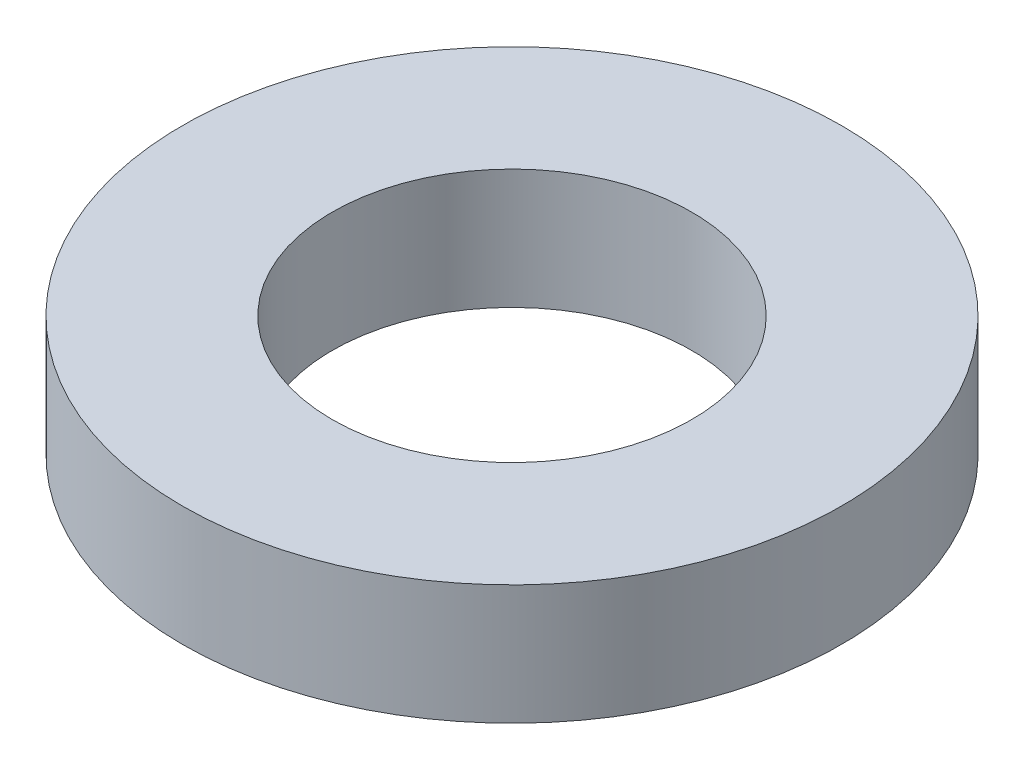
ISO-10303-21;
HEADER;
FILE_DESCRIPTION(('STEP AP214'),'2;1');
FILE_NAME('part.step','',(''),(''),'','','');
FILE_SCHEMA(('AUTOMOTIVE_DESIGN { 1 0 10303 214 1 1 1 1 }'));
ENDSEC;
DATA;
#1=APPLICATION_CONTEXT('core data for automotive mechanical design processes');
#2=APPLICATION_PROTOCOL_DEFINITION('international standard','automotive_design',2000,#1);
#3=PRODUCT_CONTEXT('',#1,'mechanical');
#4=PRODUCT('Part','Part','',(#3));
#5=PRODUCT_RELATED_PRODUCT_CATEGORY('part','',(#4));
#6=PRODUCT_DEFINITION_FORMATION('','',#4);
#7=PRODUCT_DEFINITION_CONTEXT('part definition',#1,'design');
#8=PRODUCT_DEFINITION('design','',#6,#7);
#9=PRODUCT_DEFINITION_SHAPE('','',#8);
#10=(LENGTH_UNIT() NAMED_UNIT(*) SI_UNIT(.MILLI.,.METRE.));
#11=(NAMED_UNIT(*) PLANE_ANGLE_UNIT() SI_UNIT($,.RADIAN.));
#12=(NAMED_UNIT(*) SI_UNIT($,.STERADIAN.) SOLID_ANGLE_UNIT());
#13=UNCERTAINTY_MEASURE_WITH_UNIT(LENGTH_MEASURE(1.E-05),#10,'distance_accuracy_value','');
#14=(GEOMETRIC_REPRESENTATION_CONTEXT(3) GLOBAL_UNCERTAINTY_ASSIGNED_CONTEXT((#13)) GLOBAL_UNIT_ASSIGNED_CONTEXT((#10,
#11,#12)) REPRESENTATION_CONTEXT('',''));
#15=CARTESIAN_POINT('',(0.,0.,0.));
#16=DIRECTION('',(0.,0.,1.));
#17=DIRECTION('',(1.,0.,0.));
#18=AXIS2_PLACEMENT_3D('',#15,#16,#17);
#19=CARTESIAN_POINT('',(0.,1.,0.));
#20=DIRECTION('',(0.,1.,0.));
#21=DIRECTION('',(0.,0.,1.));
#22=AXIS2_PLACEMENT_3D('',#19,#20,#21);
#23=PLANE('',#22);
#24=CARTESIAN_POINT('',(0.,1.,0.));
#25=DIRECTION('',(0.,1.,0.));
#26=DIRECTION('',(0.,0.,1.));
#27=AXIS2_PLACEMENT_3D('',#24,#25,#26);
#28=CIRCLE('',#27,2.75);
#29=CARTESIAN_POINT('',(0.,1.,2.75));
#30=VERTEX_POINT('',#29);
#31=EDGE_CURVE('E10',#30,#30,#28,.T.);
#32=ORIENTED_EDGE('',*,*,#31,.T.);
#33=EDGE_LOOP('',(#32));
#34=FACE_BOUND('',#33,.T.);
#35=CARTESIAN_POINT('',(0.,1.,0.));
#36=DIRECTION('',(0.,1.,0.));
#37=DIRECTION('',(0.,0.,1.));
#38=AXIS2_PLACEMENT_3D('',#35,#36,#37);
#39=CIRCLE('',#38,1.5);
#40=CARTESIAN_POINT('',(0.,1.,1.5));
#41=VERTEX_POINT('',#40);
#42=EDGE_CURVE('E50',#41,#41,#39,.T.);
#43=ORIENTED_EDGE('',*,*,#42,.F.);
#44=EDGE_LOOP('',(#43));
#45=FACE_BOUND('',#44,.T.);
#46=ADVANCED_FACE('F39',(#34,#45),#23,.T.);
#47=CARTESIAN_POINT('',(0.,0.,0.));
#48=DIRECTION('',(0.,1.,0.));
#49=DIRECTION('',(0.,0.,1.));
#50=AXIS2_PLACEMENT_3D('',#47,#48,#49);
#51=PLANE('',#50);
#52=CARTESIAN_POINT('',(0.,0.,0.));
#53=DIRECTION('',(0.,1.,0.));
#54=DIRECTION('',(0.,0.,1.));
#55=AXIS2_PLACEMENT_3D('',#52,#53,#54);
#56=CIRCLE('',#55,2.75);
#57=CARTESIAN_POINT('',(0.,0.,2.75));
#58=VERTEX_POINT('',#57);
#59=EDGE_CURVE('E43',#58,#58,#56,.T.);
#60=ORIENTED_EDGE('',*,*,#59,.F.);
#61=EDGE_LOOP('',(#60));
#62=FACE_BOUND('',#61,.T.);
#63=CARTESIAN_POINT('',(0.,0.,0.));
#64=DIRECTION('',(0.,1.,0.));
#65=DIRECTION('',(0.,0.,1.));
#66=AXIS2_PLACEMENT_3D('',#63,#64,#65);
#67=CIRCLE('',#66,1.5);
#68=CARTESIAN_POINT('',(0.,0.,1.5));
#69=VERTEX_POINT('',#68);
#70=EDGE_CURVE('E52',#69,#69,#67,.T.);
#71=ORIENTED_EDGE('',*,*,#70,.T.);
#72=EDGE_LOOP('',(#71));
#73=FACE_BOUND('',#72,.T.);
#74=ADVANCED_FACE('F62',(#62,#73),#51,.F.);
#75=CARTESIAN_POINT('',(0.,1.,0.));
#76=DIRECTION('',(0.,-1.,0.));
#77=DIRECTION('',(0.,0.,-1.));
#78=AXIS2_PLACEMENT_3D('',#75,#76,#77);
#79=CYLINDRICAL_SURFACE('',#78,2.75);
#80=ORIENTED_EDGE('',*,*,#31,.F.);
#81=EDGE_LOOP('',(#80));
#82=FACE_BOUND('',#81,.T.);
#83=ORIENTED_EDGE('',*,*,#59,.T.);
#84=EDGE_LOOP('',(#83));
#85=FACE_BOUND('',#84,.T.);
#86=ADVANCED_FACE('F41',(#82,#85),#79,.T.);
#87=CARTESIAN_POINT('',(0.,1.,0.));
#88=DIRECTION('',(0.,-1.,0.));
#89=DIRECTION('',(0.,0.,-1.));
#90=AXIS2_PLACEMENT_3D('',#87,#88,#89);
#91=CYLINDRICAL_SURFACE('',#90,1.5);
#92=ORIENTED_EDGE('',*,*,#42,.T.);
#93=EDGE_LOOP('',(#92));
#94=FACE_BOUND('',#93,.T.);
#95=ORIENTED_EDGE('',*,*,#70,.F.);
#96=EDGE_LOOP('',(#95));
#97=FACE_BOUND('',#96,.T.);
#98=ADVANCED_FACE('F58',(#94,#97),#91,.F.);
#99=CLOSED_SHELL('',(#46,#74,#86,#98));
#100=MANIFOLD_SOLID_BREP('B2',#99);
#101=ADVANCED_BREP_SHAPE_REPRESENTATION('',(#18,#100),#14);
#102=SHAPE_DEFINITION_REPRESENTATION(#9,#101);
ENDSEC;
END-ISO-10303-21;
